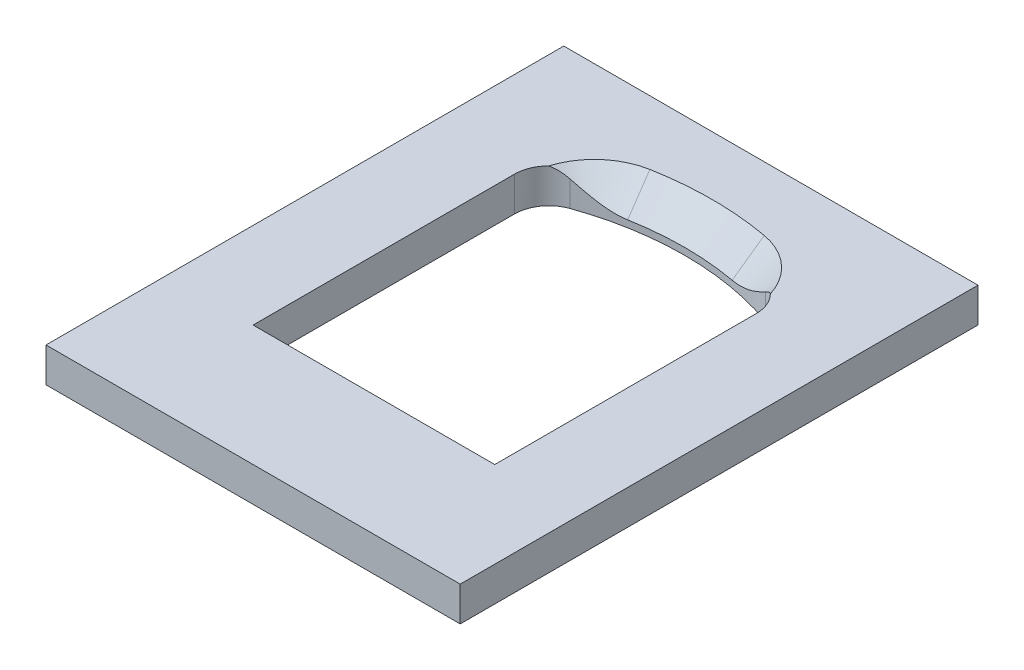
ISO-10303-21;
HEADER;
FILE_DESCRIPTION(('STEP AP214'),'2;1');
FILE_NAME('part.step','',(''),(''),'','','');
FILE_SCHEMA(('AUTOMOTIVE_DESIGN { 1 0 10303 214 1 1 1 1 }'));
ENDSEC;
DATA;
#1=APPLICATION_CONTEXT('core data for automotive mechanical design processes');
#2=APPLICATION_PROTOCOL_DEFINITION('international standard','automotive_design',2000,#1);
#3=PRODUCT_CONTEXT('',#1,'mechanical');
#4=PRODUCT('Part','Part','',(#3));
#5=PRODUCT_RELATED_PRODUCT_CATEGORY('part','',(#4));
#6=PRODUCT_DEFINITION_FORMATION('','',#4);
#7=PRODUCT_DEFINITION_CONTEXT('part definition',#1,'design');
#8=PRODUCT_DEFINITION('design','',#6,#7);
#9=PRODUCT_DEFINITION_SHAPE('','',#8);
#10=(LENGTH_UNIT() NAMED_UNIT(*) SI_UNIT(.MILLI.,.METRE.));
#11=(NAMED_UNIT(*) PLANE_ANGLE_UNIT() SI_UNIT($,.RADIAN.));
#12=(NAMED_UNIT(*) SI_UNIT($,.STERADIAN.) SOLID_ANGLE_UNIT());
#13=UNCERTAINTY_MEASURE_WITH_UNIT(LENGTH_MEASURE(1.E-05),#10,'distance_accuracy_value','');
#14=(GEOMETRIC_REPRESENTATION_CONTEXT(3) GLOBAL_UNCERTAINTY_ASSIGNED_CONTEXT((#13)) GLOBAL_UNIT_ASSIGNED_CONTEXT((#10,
#11,#12)) REPRESENTATION_CONTEXT('',''));
#15=CARTESIAN_POINT('',(0.,0.,0.));
#16=DIRECTION('',(0.,0.,1.));
#17=DIRECTION('',(1.,0.,0.));
#18=AXIS2_PLACEMENT_3D('',#15,#16,#17);
#19=CARTESIAN_POINT('',(0.,10.,0.));
#20=DIRECTION('',(0.,1.,0.));
#21=DIRECTION('',(0.,0.,1.));
#22=AXIS2_PLACEMENT_3D('',#19,#20,#21);
#23=PLANE('',#22);
#24=DIRECTION('',(1.,0.,0.));
#25=VECTOR('',#24,1.);
#26=CARTESIAN_POINT('',(-60.,10.,75.));
#27=LINE('',#26,#25);
#28=CARTESIAN_POINT('',(-60.,10.,75.));
#29=VERTEX_POINT('',#28);
#30=CARTESIAN_POINT('',(60.,10.,75.));
#31=VERTEX_POINT('',#30);
#32=EDGE_CURVE('E249',#29,#31,#27,.T.);
#33=ORIENTED_EDGE('',*,*,#32,.T.);
#34=DIRECTION('',(0.,0.,-1.));
#35=VECTOR('',#34,1.);
#36=CARTESIAN_POINT('',(60.,10.,75.));
#37=LINE('',#36,#35);
#38=CARTESIAN_POINT('',(60.,10.,-75.));
#39=VERTEX_POINT('',#38);
#40=EDGE_CURVE('E261',#31,#39,#37,.T.);
#41=ORIENTED_EDGE('',*,*,#40,.T.);
#42=DIRECTION('',(1.,0.,0.));
#43=VECTOR('',#42,1.);
#44=CARTESIAN_POINT('',(-60.,10.,-75.));
#45=LINE('',#44,#43);
#46=CARTESIAN_POINT('',(-60.,10.,-75.));
#47=VERTEX_POINT('',#46);
#48=EDGE_CURVE('E258',#47,#39,#45,.T.);
#49=ORIENTED_EDGE('',*,*,#48,.F.);
#50=DIRECTION('',(0.,0.,-1.));
#51=VECTOR('',#50,1.);
#52=CARTESIAN_POINT('',(-60.,10.,75.));
#53=LINE('',#52,#51);
#54=EDGE_CURVE('E256',#29,#47,#53,.T.);
#55=ORIENTED_EDGE('',*,*,#54,.F.);
#56=EDGE_LOOP('',(#33,#41,#49,#55));
#57=FACE_BOUND('',#56,.T.);
#58=CARTESIAN_POINT('',(-13.,10.,-36.8331399842719));
#59=DIRECTION('',(0.,1.,0.));
#60=DIRECTION('',(0.,0.,1.));
#61=AXIS2_PLACEMENT_3D('',#58,#59,#60);
#62=CIRCLE('',#61,20.);
#63=CARTESIAN_POINT('',(-16.5616438356165,10.,-56.51345230873));
#64=VERTEX_POINT('',#63);
#65=CARTESIAN_POINT('',(-32.1056679452,10.,-42.7469756573151));
#66=VERTEX_POINT('',#65);
#67=EDGE_CURVE('E146',#64,#66,#62,.T.);
#68=ORIENTED_EDGE('',*,*,#67,.F.);
#69=CARTESIAN_POINT('',(0.,10.,35.));
#70=DIRECTION('',(0.,1.,0.));
#71=DIRECTION('',(0.,0.,1.));
#72=AXIS2_PLACEMENT_3D('',#69,#70,#71);
#73=CIRCLE('',#72,93.0000000000001);
#74=CARTESIAN_POINT('',(16.5616438356165,10.,-56.5134523087299));
#75=VERTEX_POINT('',#74);
#76=EDGE_CURVE('E142',#75,#64,#73,.T.);
#77=ORIENTED_EDGE('',*,*,#76,.F.);
#78=CARTESIAN_POINT('',(13.,10.,-36.8331399842719));
#79=DIRECTION('',(0.,-1.,0.));
#80=DIRECTION('',(0.,0.,-1.));
#81=AXIS2_PLACEMENT_3D('',#78,#79,#80);
#82=CIRCLE('',#81,20.);
#83=CARTESIAN_POINT('',(32.1056679452,10.,-42.7469756573151));
#84=VERTEX_POINT('',#83);
#85=EDGE_CURVE('E149',#75,#84,#82,.T.);
#86=ORIENTED_EDGE('',*,*,#85,.T.);
#87=CARTESIAN_POINT('',(25.,10.,-35.7106781186548));
#88=DIRECTION('',(0.,1.,0.));
#89=DIRECTION('',(0.,0.,1.));
#90=AXIS2_PLACEMENT_3D('',#87,#88,#89);
#91=CIRCLE('',#90,9.99999999999999);
#92=CARTESIAN_POINT('',(35.,10.,-35.7106781186548));
#93=VERTEX_POINT('',#92);
#94=EDGE_CURVE('E275',#93,#84,#91,.T.);
#95=ORIENTED_EDGE('',*,*,#94,.F.);
#96=DIRECTION('',(0.,0.,-1.));
#97=VECTOR('',#96,1.);
#98=CARTESIAN_POINT('',(35.,10.,40.));
#99=LINE('',#98,#97);
#100=CARTESIAN_POINT('',(35.,10.,40.));
#101=VERTEX_POINT('',#100);
#102=EDGE_CURVE('E305',#101,#93,#99,.T.);
#103=ORIENTED_EDGE('',*,*,#102,.F.);
#104=DIRECTION('',(1.,0.,0.));
#105=VECTOR('',#104,1.);
#106=CARTESIAN_POINT('',(-35.,10.,40.));
#107=LINE('',#106,#105);
#108=CARTESIAN_POINT('',(-35.,10.,40.));
#109=VERTEX_POINT('',#108);
#110=EDGE_CURVE('E303',#109,#101,#107,.T.);
#111=ORIENTED_EDGE('',*,*,#110,.F.);
#112=DIRECTION('',(0.,0.,1.));
#113=VECTOR('',#112,1.);
#114=CARTESIAN_POINT('',(-35.,10.,-35.7106781186548));
#115=LINE('',#114,#113);
#116=CARTESIAN_POINT('',(-35.,10.,-35.7106781186548));
#117=VERTEX_POINT('',#116);
#118=EDGE_CURVE('E301',#117,#109,#115,.T.);
#119=ORIENTED_EDGE('',*,*,#118,.F.);
#120=CARTESIAN_POINT('',(-25.,10.,-35.7106781186548));
#121=DIRECTION('',(0.,1.,0.));
#122=DIRECTION('',(0.,0.,1.));
#123=AXIS2_PLACEMENT_3D('',#120,#121,#122);
#124=CIRCLE('',#123,10.);
#125=EDGE_CURVE('E64',#66,#117,#124,.T.);
#126=ORIENTED_EDGE('',*,*,#125,.F.);
#127=EDGE_LOOP('',(#68,#77,#86,#95,#103,#111,#119,#126));
#128=FACE_BOUND('',#127,.T.);
#129=ADVANCED_FACE('F35',(#57,#128),#23,.T.);
#130=CARTESIAN_POINT('',(25.,0.,-35.7106781186548));
#131=DIRECTION('',(0.,1.,0.));
#132=DIRECTION('',(0.,0.,1.));
#133=AXIS2_PLACEMENT_3D('',#130,#131,#132);
#134=CYLINDRICAL_SURFACE('',#133,9.99999999999999);
#135=CARTESIAN_POINT('',(28.3331333333333,7.43816555691409,-45.138839242767));
#136=CARTESIAN_POINT('',(28.6060964807598,7.6322281578971,-45.0423644787911));
#137=CARTESIAN_POINT('',(28.8772886651872,7.82262569800771,-44.9331278061678));
#138=CARTESIAN_POINT('',(29.4139765806271,8.1954718344357,-44.6886383293521));
#139=CARTESIAN_POINT('',(29.6794635578806,8.37790860452342,-44.5533483339902));
#140=CARTESIAN_POINT('',(30.1970112485378,8.73039857514949,-44.2592492138221));
#141=CARTESIAN_POINT('',(30.4492286998595,8.90061721608141,-44.1009153840607));
#142=CARTESIAN_POINT('',(30.9424875541364,9.23119480722267,-43.7590782958324));
#143=CARTESIAN_POINT('',(31.1835394597818,9.39156307132479,-43.5755993605362));
#144=CARTESIAN_POINT('',(31.5358858178458,9.62480781751178,-43.2807498856493));
#145=CARTESIAN_POINT('',(31.6523514461447,9.70170175737879,-43.1786376066579));
#146=CARTESIAN_POINT('',(31.8819270363118,9.85297431788142,-42.9676399015905));
#147=CARTESIAN_POINT('',(31.9950188717457,9.9273395765086,-42.8587251826524));
#148=CARTESIAN_POINT('',(32.1059725095951,10.0002,-42.7466680769249));
#149=B_SPLINE_CURVE_WITH_KNOTS('',3,(#135,#136,#137,#138,#139,#140,#141,#142,#143,#144,#145,
#146,#147,#148),.UNSPECIFIED.,.F.,.F.,(4,2,2,2,2,2,4),(0.,1.04551141856858,2.09252652079196,
3.12039640972381,4.14727895449505,4.66590160795672,5.18693636001701),.UNSPECIFIED.);
#150=CARTESIAN_POINT('',(28.3333333333333,7.43830773684955,-45.1387685344754));
#151=VERTEX_POINT('',#150);
#152=EDGE_CURVE('E151',#151,#84,#149,.T.);
#153=ORIENTED_EDGE('',*,*,#152,.F.);
#154=DIRECTION('',(0.,1.,0.));
#155=VECTOR('',#154,1.);
#156=CARTESIAN_POINT('',(28.3333333333333,0.,-45.1387685344754));
#157=LINE('',#156,#155);
#158=CARTESIAN_POINT('',(28.3333333333333,0.,-45.1387685344754));
#159=VERTEX_POINT('',#158);
#160=EDGE_CURVE('E268',#159,#151,#157,.T.);
#161=ORIENTED_EDGE('',*,*,#160,.F.);
#162=CARTESIAN_POINT('',(25.,0.,-35.7106781186548));
#163=DIRECTION('',(0.,1.,0.));
#164=DIRECTION('',(0.,0.,1.));
#165=AXIS2_PLACEMENT_3D('',#162,#163,#164);
#166=CIRCLE('',#165,9.99999999999999);
#167=CARTESIAN_POINT('',(35.,0.,-35.7106781186548));
#168=VERTEX_POINT('',#167);
#169=EDGE_CURVE('E291',#168,#159,#166,.T.);
#170=ORIENTED_EDGE('',*,*,#169,.F.);
#171=DIRECTION('',(0.,1.,0.));
#172=VECTOR('',#171,1.);
#173=CARTESIAN_POINT('',(35.,0.,-35.7106781186548));
#174=LINE('',#173,#172);
#175=EDGE_CURVE('E272',#168,#93,#174,.T.);
#176=ORIENTED_EDGE('',*,*,#175,.T.);
#177=ORIENTED_EDGE('',*,*,#94,.T.);
#178=EDGE_LOOP('',(#153,#161,#170,#176,#177));
#179=FACE_BOUND('',#178,.T.);
#180=ADVANCED_FACE('F188',(#179),#134,.F.);
#181=CARTESIAN_POINT('',(-60.,10.,75.));
#182=DIRECTION('',(0.,0.,-1.));
#183=DIRECTION('',(-1.,0.,0.));
#184=AXIS2_PLACEMENT_3D('',#181,#182,#183);
#185=PLANE('',#184);
#186=DIRECTION('',(1.,0.,0.));
#187=VECTOR('',#186,1.);
#188=CARTESIAN_POINT('',(-60.,0.,75.));
#189=LINE('',#188,#187);
#190=CARTESIAN_POINT('',(-60.,0.,75.));
#191=VERTEX_POINT('',#190);
#192=CARTESIAN_POINT('',(60.,0.,75.));
#193=VERTEX_POINT('',#192);
#194=EDGE_CURVE('E242',#191,#193,#189,.T.);
#195=ORIENTED_EDGE('',*,*,#194,.T.);
#196=DIRECTION('',(0.,-1.,0.));
#197=VECTOR('',#196,1.);
#198=CARTESIAN_POINT('',(60.,10.,75.));
#199=LINE('',#198,#197);
#200=EDGE_CURVE('E186',#31,#193,#199,.T.);
#201=ORIENTED_EDGE('',*,*,#200,.F.);
#202=ORIENTED_EDGE('',*,*,#32,.F.);
#203=DIRECTION('',(0.,-1.,0.));
#204=VECTOR('',#203,1.);
#205=CARTESIAN_POINT('',(-60.,10.,75.));
#206=LINE('',#205,#204);
#207=EDGE_CURVE('E253',#29,#191,#206,.T.);
#208=ORIENTED_EDGE('',*,*,#207,.T.);
#209=EDGE_LOOP('',(#195,#201,#202,#208));
#210=FACE_BOUND('',#209,.T.);
#211=ADVANCED_FACE('F37',(#210),#185,.F.);
#212=CARTESIAN_POINT('',(60.,10.,75.));
#213=DIRECTION('',(-1.,0.,0.));
#214=DIRECTION('',(0.,0.,1.));
#215=AXIS2_PLACEMENT_3D('',#212,#213,#214);
#216=PLANE('',#215);
#217=DIRECTION('',(0.,0.,-1.));
#218=VECTOR('',#217,1.);
#219=CARTESIAN_POINT('',(60.,0.,75.));
#220=LINE('',#219,#218);
#221=CARTESIAN_POINT('',(60.,0.,-75.));
#222=VERTEX_POINT('',#221);
#223=EDGE_CURVE('E233',#193,#222,#220,.T.);
#224=ORIENTED_EDGE('',*,*,#223,.T.);
#225=DIRECTION('',(0.,-1.,0.));
#226=VECTOR('',#225,1.);
#227=CARTESIAN_POINT('',(60.,10.,-75.));
#228=LINE('',#227,#226);
#229=EDGE_CURVE('E235',#39,#222,#228,.T.);
#230=ORIENTED_EDGE('',*,*,#229,.F.);
#231=ORIENTED_EDGE('',*,*,#40,.F.);
#232=ORIENTED_EDGE('',*,*,#200,.T.);
#233=EDGE_LOOP('',(#224,#230,#231,#232));
#234=FACE_BOUND('',#233,.T.);
#235=ADVANCED_FACE('F222',(#234),#216,.F.);
#236=CARTESIAN_POINT('',(-60.,10.,-75.));
#237=DIRECTION('',(0.,0.,-1.));
#238=DIRECTION('',(-1.,0.,0.));
#239=AXIS2_PLACEMENT_3D('',#236,#237,#238);
#240=PLANE('',#239);
#241=DIRECTION('',(1.,0.,0.));
#242=VECTOR('',#241,1.);
#243=CARTESIAN_POINT('',(-60.,0.,-75.));
#244=LINE('',#243,#242);
#245=CARTESIAN_POINT('',(-60.,0.,-75.));
#246=VERTEX_POINT('',#245);
#247=EDGE_CURVE('E241',#246,#222,#244,.T.);
#248=ORIENTED_EDGE('',*,*,#247,.F.);
#249=DIRECTION('',(0.,-1.,0.));
#250=VECTOR('',#249,1.);
#251=CARTESIAN_POINT('',(-60.,10.,-75.));
#252=LINE('',#251,#250);
#253=EDGE_CURVE('E255',#47,#246,#252,.T.);
#254=ORIENTED_EDGE('',*,*,#253,.F.);
#255=ORIENTED_EDGE('',*,*,#48,.T.);
#256=ORIENTED_EDGE('',*,*,#229,.T.);
#257=EDGE_LOOP('',(#248,#254,#255,#256));
#258=FACE_BOUND('',#257,.T.);
#259=ADVANCED_FACE('F219',(#258),#240,.T.);
#260=CARTESIAN_POINT('',(-60.,10.,75.));
#261=DIRECTION('',(-1.,0.,0.));
#262=DIRECTION('',(0.,0.,1.));
#263=AXIS2_PLACEMENT_3D('',#260,#261,#262);
#264=PLANE('',#263);
#265=DIRECTION('',(0.,0.,-1.));
#266=VECTOR('',#265,1.);
#267=CARTESIAN_POINT('',(-60.,0.,75.));
#268=LINE('',#267,#266);
#269=EDGE_CURVE('E247',#191,#246,#268,.T.);
#270=ORIENTED_EDGE('',*,*,#269,.F.);
#271=ORIENTED_EDGE('',*,*,#207,.F.);
#272=ORIENTED_EDGE('',*,*,#54,.T.);
#273=ORIENTED_EDGE('',*,*,#253,.T.);
#274=EDGE_LOOP('',(#270,#271,#272,#273));
#275=FACE_BOUND('',#274,.T.);
#276=ADVANCED_FACE('F215',(#275),#264,.T.);
#277=CARTESIAN_POINT('',(0.,0.,0.));
#278=DIRECTION('',(0.,1.,0.));
#279=DIRECTION('',(0.,0.,1.));
#280=AXIS2_PLACEMENT_3D('',#277,#278,#279);
#281=PLANE('',#280);
#282=CARTESIAN_POINT('',(0.,0.,35.));
#283=DIRECTION('',(0.,1.,0.));
#284=DIRECTION('',(0.,0.,1.));
#285=AXIS2_PLACEMENT_3D('',#282,#283,#284);
#286=CIRCLE('',#285,85.);
#287=CARTESIAN_POINT('',(-28.3333333333333,0.,-45.1387685344754));
#288=VERTEX_POINT('',#287);
#289=EDGE_CURVE('E284',#159,#288,#286,.T.);
#290=ORIENTED_EDGE('',*,*,#289,.T.);
#291=CARTESIAN_POINT('',(-25.,0.,-35.7106781186548));
#292=DIRECTION('',(0.,1.,0.));
#293=DIRECTION('',(0.,0.,1.));
#294=AXIS2_PLACEMENT_3D('',#291,#292,#293);
#295=CIRCLE('',#294,10.);
#296=CARTESIAN_POINT('',(-35.,0.,-35.7106781186548));
#297=VERTEX_POINT('',#296);
#298=EDGE_CURVE('E308',#288,#297,#295,.T.);
#299=ORIENTED_EDGE('',*,*,#298,.T.);
#300=DIRECTION('',(0.,0.,1.));
#301=VECTOR('',#300,1.);
#302=CARTESIAN_POINT('',(-35.,0.,-35.7106781186548));
#303=LINE('',#302,#301);
#304=CARTESIAN_POINT('',(-35.,0.,40.));
#305=VERTEX_POINT('',#304);
#306=EDGE_CURVE('E309',#297,#305,#303,.T.);
#307=ORIENTED_EDGE('',*,*,#306,.T.);
#308=DIRECTION('',(1.,0.,0.));
#309=VECTOR('',#308,1.);
#310=CARTESIAN_POINT('',(-35.,0.,40.));
#311=LINE('',#310,#309);
#312=CARTESIAN_POINT('',(35.,0.,40.));
#313=VERTEX_POINT('',#312);
#314=EDGE_CURVE('E311',#305,#313,#311,.T.);
#315=ORIENTED_EDGE('',*,*,#314,.T.);
#316=DIRECTION('',(0.,0.,-1.));
#317=VECTOR('',#316,1.);
#318=CARTESIAN_POINT('',(35.,0.,40.));
#319=LINE('',#318,#317);
#320=EDGE_CURVE('E296',#313,#168,#319,.T.);
#321=ORIENTED_EDGE('',*,*,#320,.T.);
#322=ORIENTED_EDGE('',*,*,#169,.T.);
#323=EDGE_LOOP('',(#290,#299,#307,#315,#321,#322));
#324=FACE_BOUND('',#323,.T.);
#325=ORIENTED_EDGE('',*,*,#194,.F.);
#326=ORIENTED_EDGE('',*,*,#269,.T.);
#327=ORIENTED_EDGE('',*,*,#247,.T.);
#328=ORIENTED_EDGE('',*,*,#223,.F.);
#329=EDGE_LOOP('',(#325,#326,#327,#328));
#330=FACE_BOUND('',#329,.T.);
#331=ADVANCED_FACE('F209',(#324,#330),#281,.F.);
#332=CARTESIAN_POINT('',(-25.,0.,-35.7106781186548));
#333=DIRECTION('',(0.,1.,0.));
#334=DIRECTION('',(0.,0.,1.));
#335=AXIS2_PLACEMENT_3D('',#332,#333,#334);
#336=CYLINDRICAL_SURFACE('',#335,10.);
#337=DIRECTION('',(0.,1.,0.));
#338=VECTOR('',#337,1.);
#339=CARTESIAN_POINT('',(-28.3333333333333,0.,-45.1387685344754));
#340=LINE('',#339,#338);
#341=CARTESIAN_POINT('',(-28.3333333333333,7.43830773684953,-45.1387685344754));
#342=VERTEX_POINT('',#341);
#343=EDGE_CURVE('E266',#288,#342,#340,.T.);
#344=ORIENTED_EDGE('',*,*,#343,.T.);
#345=CARTESIAN_POINT('',(-28.3331333333333,7.43816555691408,-45.1388392427671));
#346=CARTESIAN_POINT('',(-28.6060964807597,7.63222815789709,-45.0423644787911));
#347=CARTESIAN_POINT('',(-28.8772886651871,7.8226256980077,-44.9331278061679));
#348=CARTESIAN_POINT('',(-29.413976580627,8.19547183443569,-44.6886383293521));
#349=CARTESIAN_POINT('',(-29.6794635578806,8.37790860452341,-44.5533483339902));
#350=CARTESIAN_POINT('',(-30.1970112485378,8.73039857514948,-44.2592492138221));
#351=CARTESIAN_POINT('',(-30.4492286998595,8.9006172160814,-44.1009153840608));
#352=CARTESIAN_POINT('',(-30.9424875541364,9.23119480722266,-43.7590782958324));
#353=CARTESIAN_POINT('',(-31.1835394597818,9.39156307132478,-43.5755993605362));
#354=CARTESIAN_POINT('',(-31.5358858178458,9.62480781751177,-43.2807498856493));
#355=CARTESIAN_POINT('',(-31.6523514461446,9.70170175737878,-43.1786376066579));
#356=CARTESIAN_POINT('',(-31.8819270363118,9.85297431788141,-42.9676399015905));
#357=CARTESIAN_POINT('',(-31.9950188717457,9.92733957650859,-42.8587251826524));
#358=CARTESIAN_POINT('',(-32.1059725095951,10.0002,-42.746668076925));
#359=B_SPLINE_CURVE_WITH_KNOTS('',3,(#345,#346,#347,#348,#349,#350,#351,#352,#353,#354,#355,
#356,#357,#358),.UNSPECIFIED.,.F.,.F.,(4,2,2,2,2,2,4),(0.,1.04551141856858,2.09252652079197,
3.1203964097238,4.14727895449505,4.66590160795672,5.18693636001701),.UNSPECIFIED.);
#360=EDGE_CURVE('E166',#342,#66,#359,.T.);
#361=ORIENTED_EDGE('',*,*,#360,.T.);
#362=ORIENTED_EDGE('',*,*,#125,.T.);
#363=DIRECTION('',(0.,1.,0.));
#364=VECTOR('',#363,1.);
#365=CARTESIAN_POINT('',(-35.,0.,-35.7106781186548));
#366=LINE('',#365,#364);
#367=EDGE_CURVE('E283',#297,#117,#366,.T.);
#368=ORIENTED_EDGE('',*,*,#367,.F.);
#369=ORIENTED_EDGE('',*,*,#298,.F.);
#370=EDGE_LOOP('',(#344,#361,#362,#368,#369));
#371=FACE_BOUND('',#370,.T.);
#372=ADVANCED_FACE('F205',(#371),#336,.F.);
#373=CARTESIAN_POINT('',(0.,0.,35.));
#374=DIRECTION('',(0.,1.,0.));
#375=DIRECTION('',(0.,0.,1.));
#376=AXIS2_PLACEMENT_3D('',#373,#374,#375);
#377=CYLINDRICAL_SURFACE('',#376,85.);
#378=CARTESIAN_POINT('',(0.,1.99999999999999,35.));
#379=DIRECTION('',(0.,1.,0.));
#380=DIRECTION('',(0.,0.,1.));
#381=AXIS2_PLACEMENT_3D('',#378,#379,#380);
#382=CIRCLE('',#381,85.);
#383=CARTESIAN_POINT('',(15.1369863013699,2.00000000000006,-48.6413273789467));
#384=VERTEX_POINT('',#383);
#385=CARTESIAN_POINT('',(-15.1369863013699,1.99999999999999,-48.6413273789467));
#386=VERTEX_POINT('',#385);
#387=EDGE_CURVE('E49',#384,#386,#382,.T.);
#388=ORIENTED_EDGE('',*,*,#387,.T.);
#389=CARTESIAN_POINT('',(-12.9998,2.1668909695091,-49.0000309521372));
#390=CARTESIAN_POINT('',(-13.1947363867499,2.13670288962225,-48.9698642330682));
#391=CARTESIAN_POINT('',(-13.3901728582128,2.1104600529784,-48.9389222568908));
#392=CARTESIAN_POINT('',(-13.7817360662588,2.0661228468225,-48.8755209993191));
#393=CARTESIAN_POINT('',(-13.977862852191,2.04802907230344,-48.8430616073236));
#394=CARTESIAN_POINT('',(-14.3703334708047,2.02026198851938,-48.7766859325586));
#395=CARTESIAN_POINT('',(-14.5666770620619,2.01058290729607,-48.742770665213));
#396=CARTESIAN_POINT('',(-14.9593303600618,1.99974420754583,-48.6735215100324));
#397=CARTESIAN_POINT('',(-15.1556400677066,1.99858430879561,-48.6381876688973));
#398=CARTESIAN_POINT('',(-15.736654829956,2.00783064706214,-48.53149485952));
#399=CARTESIAN_POINT('',(-16.1208764153698,2.03044029110281,-48.458187001473));
#400=CARTESIAN_POINT('',(-16.8851433257579,2.10750421401158,-48.3069252399545));
#401=CARTESIAN_POINT('',(-17.2651882885667,2.16196123259284,-48.2289709372844));
#402=CARTESIAN_POINT('',(-17.902154644855,2.27866407406802,-48.0938241995346));
#403=CARTESIAN_POINT('',(-18.1607363744064,2.33326734973049,-48.0376834770708));
#404=CARTESIAN_POINT('',(-18.6744854532435,2.45527318202683,-47.9236566986152));
#405=CARTESIAN_POINT('',(-18.929652442089,2.52267707858871,-47.8657704604424));
#406=CARTESIAN_POINT('',(-19.6897695319052,2.74238561622023,-47.6896820730438));
#407=CARTESIAN_POINT('',(-20.1891639518325,2.91215418904132,-47.5690868199283));
#408=CARTESIAN_POINT('',(-21.1778367396664,3.29087201673944,-47.3210926809516));
#409=CARTESIAN_POINT('',(-21.6669289837269,3.50025548265435,-47.1936308098899));
#410=CARTESIAN_POINT('',(-22.6298427879357,3.94839412233932,-46.9337465854277));
#411=CARTESIAN_POINT('',(-23.1036674312019,4.18714331852748,-46.8013252453632));
#412=CARTESIAN_POINT('',(-23.9904027829211,4.66208069581831,-46.5453948674028));
#413=CARTESIAN_POINT('',(-24.4046268556733,4.8960849058246,-46.4223393119548));
#414=CARTESIAN_POINT('',(-25.2232722606986,5.37876926071594,-46.1724688135547));
#415=CARTESIAN_POINT('',(-25.6276929616498,5.62745034724563,-46.0456536296513));
#416=CARTESIAN_POINT('',(-26.4199075551956,6.1315442783723,-45.7908297412203));
#417=CARTESIAN_POINT('',(-26.8078720904711,6.3867268466308,-45.6628941955889));
#418=CARTESIAN_POINT('',(-27.3841396950477,6.77633956578599,-45.4683164674715));
#419=CARTESIAN_POINT('',(-27.5752447171429,6.90732340830455,-45.4030248128436));
#420=CARTESIAN_POINT('',(-27.9556869705532,7.17137468312495,-45.2715395273122));
#421=CARTESIAN_POINT('',(-28.1450242622887,7.3044420437935,-45.2053459274287));
#422=CARTESIAN_POINT('',(-28.3335333333333,7.43844991693591,-45.1386978235165));
#423=B_SPLINE_CURVE_WITH_KNOTS('',3,(#389,#390,#391,#392,#393,#394,#395,#396,#397,#398,#399,
#400,#401,#402,#403,#404,#405,#406,#407,#408,#409,#410,#411,#412,#413,#414,#415,#416,#417,#418,
#419,#420,#421,#422),.UNSPECIFIED.,.F.,.F.,(4,2,2,2,2,2,2,2,2,2,2,2,2,2,2,2,4),(0.,
0.598631597507623,1.19730689622535,1.79557121603165,2.39381585691372,3.56771765574367,
4.74172045591067,5.55193220272995,6.36222880671404,7.98335597060117,9.62340597279568,
11.2631226831252,12.7369713741757,14.2109147279825,15.6557189551064,16.3778323359623,
17.099920944172),.UNSPECIFIED.);
#424=EDGE_CURVE('E11',#386,#342,#423,.T.);
#425=ORIENTED_EDGE('',*,*,#424,.T.);
#426=ORIENTED_EDGE('',*,*,#343,.F.);
#427=ORIENTED_EDGE('',*,*,#289,.F.);
#428=ORIENTED_EDGE('',*,*,#160,.T.);
#429=CARTESIAN_POINT('',(12.9998,2.16689096950911,-49.0000309521372));
#430=CARTESIAN_POINT('',(13.19473638675,2.13670288962227,-48.9698642330682));
#431=CARTESIAN_POINT('',(13.3901728582128,2.11046005297842,-48.9389222568908));
#432=CARTESIAN_POINT('',(13.7817360662588,2.06612284682253,-48.8755209993191));
#433=CARTESIAN_POINT('',(13.9778628521911,2.04802907230346,-48.8430616073236));
#434=CARTESIAN_POINT('',(14.3703334708047,2.02026198851939,-48.7766859325586));
#435=CARTESIAN_POINT('',(14.566677062062,2.01058290729608,-48.742770665213));
#436=CARTESIAN_POINT('',(14.9593303600618,1.99974420754585,-48.6735215100324));
#437=CARTESIAN_POINT('',(15.1556400677066,1.99858430879564,-48.6381876688973));
#438=CARTESIAN_POINT('',(15.7366548299561,2.00783064706219,-48.53149485952));
#439=CARTESIAN_POINT('',(16.1208764153698,2.03044029110285,-48.458187001473));
#440=CARTESIAN_POINT('',(16.8851433257579,2.10750421401159,-48.3069252399545));
#441=CARTESIAN_POINT('',(17.2651882885667,2.16196123259284,-48.2289709372844));
#442=CARTESIAN_POINT('',(17.9021546448551,2.27866407406803,-48.0938241995346));
#443=CARTESIAN_POINT('',(18.1607363744065,2.3332673497305,-48.0376834770708));
#444=CARTESIAN_POINT('',(18.6744854532435,2.45527318202685,-47.9236566986152));
#445=CARTESIAN_POINT('',(18.9296524420891,2.52267707858873,-47.8657704604424));
#446=CARTESIAN_POINT('',(19.6897695319052,2.74238561622025,-47.6896820730438));
#447=CARTESIAN_POINT('',(20.1891639518326,2.91215418904133,-47.5690868199283));
#448=CARTESIAN_POINT('',(21.1778367396664,3.29087201673944,-47.3210926809515));
#449=CARTESIAN_POINT('',(21.6669289837269,3.50025548265436,-47.1936308098899));
#450=CARTESIAN_POINT('',(22.6298427879357,3.94839412233933,-46.9337465854277));
#451=CARTESIAN_POINT('',(23.1036674312019,4.1871433185275,-46.8013252453632));
#452=CARTESIAN_POINT('',(23.9904027829211,4.66208069581832,-46.5453948674028));
#453=CARTESIAN_POINT('',(24.4046268556733,4.8960849058246,-46.4223393119548));
#454=CARTESIAN_POINT('',(25.2232722606986,5.37876926071595,-46.1724688135547));
#455=CARTESIAN_POINT('',(25.6276929616498,5.62745034724564,-46.0456536296513));
#456=CARTESIAN_POINT('',(26.4199075551956,6.13154427837232,-45.7908297412203));
#457=CARTESIAN_POINT('',(26.8078720904711,6.38672684663082,-45.6628941955889));
#458=CARTESIAN_POINT('',(27.3841396950478,6.776339565786,-45.4683164674715));
#459=CARTESIAN_POINT('',(27.575244717143,6.90732340830456,-45.4030248128435));
#460=CARTESIAN_POINT('',(27.9556869705532,7.17137468312496,-45.2715395273122));
#461=CARTESIAN_POINT('',(28.1450242622887,7.30444204379352,-45.2053459274287));
#462=CARTESIAN_POINT('',(28.3335333333333,7.43844991693592,-45.1386978235165));
#463=B_SPLINE_CURVE_WITH_KNOTS('',3,(#429,#430,#431,#432,#433,#434,#435,#436,#437,#438,#439,
#440,#441,#442,#443,#444,#445,#446,#447,#448,#449,#450,#451,#452,#453,#454,#455,#456,#457,#458,
#459,#460,#461,#462),.UNSPECIFIED.,.F.,.F.,(4,2,2,2,2,2,2,2,2,2,2,2,2,2,2,2,4),(0.,
0.598631597507622,1.19730689622535,1.79557121603164,2.39381585691372,3.56771765574366,
4.74172045591066,5.55193220272993,6.36222880671402,7.98335597060115,9.62340597279567,
11.2631226831252,12.7369713741757,14.2109147279824,15.6557189551064,16.3778323359623,
17.099920944172),.UNSPECIFIED.);
#464=EDGE_CURVE('E56',#384,#151,#463,.T.);
#465=ORIENTED_EDGE('',*,*,#464,.F.);
#466=EDGE_LOOP('',(#388,#425,#426,#427,#428,#465));
#467=FACE_BOUND('',#466,.T.);
#468=ADVANCED_FACE('F173',(#467),#377,.F.);
#469=CARTESIAN_POINT('',(35.,0.,40.));
#470=DIRECTION('',(1.,0.,0.));
#471=DIRECTION('',(0.,0.,-1.));
#472=AXIS2_PLACEMENT_3D('',#469,#470,#471);
#473=PLANE('',#472);
#474=ORIENTED_EDGE('',*,*,#102,.T.);
#475=ORIENTED_EDGE('',*,*,#175,.F.);
#476=ORIENTED_EDGE('',*,*,#320,.F.);
#477=DIRECTION('',(0.,1.,0.));
#478=VECTOR('',#477,1.);
#479=CARTESIAN_POINT('',(35.,0.,40.));
#480=LINE('',#479,#478);
#481=EDGE_CURVE('E279',#313,#101,#480,.T.);
#482=ORIENTED_EDGE('',*,*,#481,.T.);
#483=EDGE_LOOP('',(#474,#475,#476,#482));
#484=FACE_BOUND('',#483,.T.);
#485=ADVANCED_FACE('F193',(#484),#473,.F.);
#486=CARTESIAN_POINT('',(-35.,0.,40.));
#487=DIRECTION('',(0.,0.,1.));
#488=DIRECTION('',(1.,0.,0.));
#489=AXIS2_PLACEMENT_3D('',#486,#487,#488);
#490=PLANE('',#489);
#491=ORIENTED_EDGE('',*,*,#110,.T.);
#492=ORIENTED_EDGE('',*,*,#481,.F.);
#493=ORIENTED_EDGE('',*,*,#314,.F.);
#494=DIRECTION('',(0.,1.,0.));
#495=VECTOR('',#494,1.);
#496=CARTESIAN_POINT('',(-35.,0.,40.));
#497=LINE('',#496,#495);
#498=EDGE_CURVE('E281',#305,#109,#497,.T.);
#499=ORIENTED_EDGE('',*,*,#498,.T.);
#500=EDGE_LOOP('',(#491,#492,#493,#499));
#501=FACE_BOUND('',#500,.T.);
#502=ADVANCED_FACE('F196',(#501),#490,.F.);
#503=CARTESIAN_POINT('',(-35.,0.,-35.7106781186548));
#504=DIRECTION('',(-1.,0.,0.));
#505=DIRECTION('',(0.,0.,1.));
#506=AXIS2_PLACEMENT_3D('',#503,#504,#505);
#507=PLANE('',#506);
#508=ORIENTED_EDGE('',*,*,#118,.T.);
#509=ORIENTED_EDGE('',*,*,#498,.F.);
#510=ORIENTED_EDGE('',*,*,#306,.F.);
#511=ORIENTED_EDGE('',*,*,#367,.T.);
#512=EDGE_LOOP('',(#508,#509,#510,#511));
#513=FACE_BOUND('',#512,.T.);
#514=ADVANCED_FACE('F200',(#513),#507,.F.);
#515=CARTESIAN_POINT('',(-13.,10.,-36.8331399842719));
#516=DIRECTION('',(0.,1.,0.));
#517=DIRECTION('',(0.,0.,1.));
#518=AXIS2_PLACEMENT_3D('',#515,#516,#517);
#519=CONICAL_SURFACE('',#518,20.,0.78539816339745);
#520=ORIENTED_EDGE('',*,*,#424,.F.);
#521=DIRECTION('',(-0.125923125416783,0.707106781186546,-0.695804115024675));
#522=VECTOR('',#521,1.);
#523=CARTESIAN_POINT('',(-16.5616438356165,10.,-56.51345230873));
#524=LINE('',#523,#522);
#525=EDGE_CURVE('E145',#386,#64,#524,.T.);
#526=ORIENTED_EDGE('',*,*,#525,.T.);
#527=ORIENTED_EDGE('',*,*,#67,.T.);
#528=ORIENTED_EDGE('',*,*,#360,.F.);
#529=EDGE_LOOP('',(#520,#526,#527,#528));
#530=FACE_BOUND('',#529,.T.);
#531=ADVANCED_FACE('F203',(#530),#519,.F.);
#532=CARTESIAN_POINT('',(0.,10.,35.));
#533=DIRECTION('',(0.,1.,0.));
#534=DIRECTION('',(0.,0.,1.));
#535=AXIS2_PLACEMENT_3D('',#532,#533,#534);
#536=CONICAL_SURFACE('',#535,93.0000000000001,0.78539816339745);
#537=DIRECTION('',(0.125923125416783,0.707106781186546,-0.695804115024675));
#538=VECTOR('',#537,1.);
#539=CARTESIAN_POINT('',(16.5616438356165,10.,-56.5134523087299));
#540=LINE('',#539,#538);
#541=EDGE_CURVE('E137',#384,#75,#540,.T.);
#542=ORIENTED_EDGE('',*,*,#541,.T.);
#543=ORIENTED_EDGE('',*,*,#76,.T.);
#544=ORIENTED_EDGE('',*,*,#525,.F.);
#545=ORIENTED_EDGE('',*,*,#387,.F.);
#546=EDGE_LOOP('',(#542,#543,#544,#545));
#547=FACE_BOUND('',#546,.T.);
#548=ADVANCED_FACE('F139',(#547),#536,.F.);
#549=CARTESIAN_POINT('',(13.,10.,-36.8331399842719));
#550=DIRECTION('',(0.,1.,0.));
#551=DIRECTION('',(0.,0.,-1.));
#552=AXIS2_PLACEMENT_3D('',#549,#550,#551);
#553=CONICAL_SURFACE('',#552,20.,0.78539816339745);
#554=ORIENTED_EDGE('',*,*,#464,.T.);
#555=ORIENTED_EDGE('',*,*,#152,.T.);
#556=ORIENTED_EDGE('',*,*,#85,.F.);
#557=ORIENTED_EDGE('',*,*,#541,.F.);
#558=EDGE_LOOP('',(#554,#555,#556,#557));
#559=FACE_BOUND('',#558,.T.);
#560=ADVANCED_FACE('F150',(#559),#553,.F.);
#561=CLOSED_SHELL('',(#129,#180,#211,#235,#259,#276,#331,#372,#468,#485,#502,#514,#531,#548,#560));
#562=MANIFOLD_SOLID_BREP('B2',#561);
#563=ADVANCED_BREP_SHAPE_REPRESENTATION('',(#18,#562),#14);
#564=SHAPE_DEFINITION_REPRESENTATION(#9,#563);
ENDSEC;
END-ISO-10303-21;
